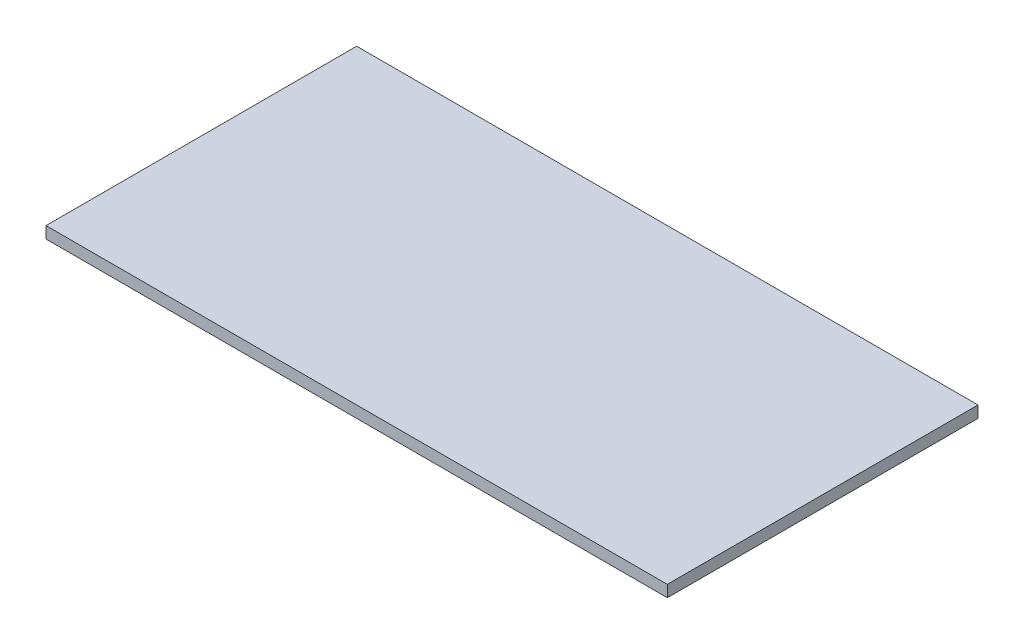
ISO-10303-21;
HEADER;
FILE_DESCRIPTION(('STEP AP214'),'2;1');
FILE_NAME('part.step','',(''),(''),'','','');
FILE_SCHEMA(('AUTOMOTIVE_DESIGN { 1 0 10303 214 1 1 1 1 }'));
ENDSEC;
DATA;
#1=APPLICATION_CONTEXT('core data for automotive mechanical design processes');
#2=APPLICATION_PROTOCOL_DEFINITION('international standard','automotive_design',2000,#1);
#3=PRODUCT_CONTEXT('',#1,'mechanical');
#4=PRODUCT('Part','Part','',(#3));
#5=PRODUCT_RELATED_PRODUCT_CATEGORY('part','',(#4));
#6=PRODUCT_DEFINITION_FORMATION('','',#4);
#7=PRODUCT_DEFINITION_CONTEXT('part definition',#1,'design');
#8=PRODUCT_DEFINITION('design','',#6,#7);
#9=PRODUCT_DEFINITION_SHAPE('','',#8);
#10=(LENGTH_UNIT() NAMED_UNIT(*) SI_UNIT(.MILLI.,.METRE.));
#11=(NAMED_UNIT(*) PLANE_ANGLE_UNIT() SI_UNIT($,.RADIAN.));
#12=(NAMED_UNIT(*) SI_UNIT($,.STERADIAN.) SOLID_ANGLE_UNIT());
#13=UNCERTAINTY_MEASURE_WITH_UNIT(LENGTH_MEASURE(1.E-05),#10,'distance_accuracy_value','');
#14=(GEOMETRIC_REPRESENTATION_CONTEXT(3) GLOBAL_UNCERTAINTY_ASSIGNED_CONTEXT((#13)) GLOBAL_UNIT_ASSIGNED_CONTEXT((#10,
#11,#12)) REPRESENTATION_CONTEXT('',''));
#15=CARTESIAN_POINT('',(0.,0.,0.));
#16=DIRECTION('',(0.,0.,1.));
#17=DIRECTION('',(1.,0.,0.));
#18=AXIS2_PLACEMENT_3D('',#15,#16,#17);
#19=CARTESIAN_POINT('',(0.,15.,0.));
#20=DIRECTION('',(1.,0.,0.));
#21=DIRECTION('',(0.,0.,-1.));
#22=AXIS2_PLACEMENT_3D('',#19,#20,#21);
#23=PLANE('',#22);
#24=DIRECTION('',(0.,0.,1.));
#25=VECTOR('',#24,1.);
#26=CARTESIAN_POINT('',(0.,0.,0.));
#27=LINE('',#26,#25);
#28=CARTESIAN_POINT('',(0.,0.,-400.));
#29=VERTEX_POINT('',#28);
#30=CARTESIAN_POINT('',(0.,0.,0.));
#31=VERTEX_POINT('',#30);
#32=EDGE_CURVE('E96',#29,#31,#27,.T.);
#33=ORIENTED_EDGE('',*,*,#32,.T.);
#34=DIRECTION('',(0.,-1.,0.));
#35=VECTOR('',#34,1.);
#36=CARTESIAN_POINT('',(0.,15.,0.));
#37=LINE('',#36,#35);
#38=CARTESIAN_POINT('',(0.,15.,0.));
#39=VERTEX_POINT('',#38);
#40=EDGE_CURVE('E11',#39,#31,#37,.T.);
#41=ORIENTED_EDGE('',*,*,#40,.F.);
#42=DIRECTION('',(0.,0.,1.));
#43=VECTOR('',#42,1.);
#44=CARTESIAN_POINT('',(0.,15.,0.));
#45=LINE('',#44,#43);
#46=CARTESIAN_POINT('',(0.,15.,-400.));
#47=VERTEX_POINT('',#46);
#48=EDGE_CURVE('E84',#47,#39,#45,.T.);
#49=ORIENTED_EDGE('',*,*,#48,.F.);
#50=DIRECTION('',(0.,-1.,0.));
#51=VECTOR('',#50,1.);
#52=CARTESIAN_POINT('',(0.,15.,-400.));
#53=LINE('',#52,#51);
#54=EDGE_CURVE('E92',#47,#29,#53,.T.);
#55=ORIENTED_EDGE('',*,*,#54,.T.);
#56=EDGE_LOOP('',(#33,#41,#49,#55));
#57=FACE_BOUND('',#56,.T.);
#58=ADVANCED_FACE('F33',(#57),#23,.F.);
#59=CARTESIAN_POINT('',(0.,15.,0.));
#60=DIRECTION('',(0.,0.,-1.));
#61=DIRECTION('',(-1.,0.,0.));
#62=AXIS2_PLACEMENT_3D('',#59,#60,#61);
#63=PLANE('',#62);
#64=DIRECTION('',(1.,0.,0.));
#65=VECTOR('',#64,1.);
#66=CARTESIAN_POINT('',(0.,0.,0.));
#67=LINE('',#66,#65);
#68=CARTESIAN_POINT('',(800.,0.,0.));
#69=VERTEX_POINT('',#68);
#70=EDGE_CURVE('E88',#31,#69,#67,.T.);
#71=ORIENTED_EDGE('',*,*,#70,.T.);
#72=DIRECTION('',(0.,-1.,0.));
#73=VECTOR('',#72,1.);
#74=CARTESIAN_POINT('',(800.,15.,0.));
#75=LINE('',#74,#73);
#76=CARTESIAN_POINT('',(800.,15.,0.));
#77=VERTEX_POINT('',#76);
#78=EDGE_CURVE('E41',#77,#69,#75,.T.);
#79=ORIENTED_EDGE('',*,*,#78,.F.);
#80=DIRECTION('',(1.,0.,0.));
#81=VECTOR('',#80,1.);
#82=CARTESIAN_POINT('',(0.,15.,0.));
#83=LINE('',#82,#81);
#84=EDGE_CURVE('E79',#39,#77,#83,.T.);
#85=ORIENTED_EDGE('',*,*,#84,.F.);
#86=ORIENTED_EDGE('',*,*,#40,.T.);
#87=EDGE_LOOP('',(#71,#79,#85,#86));
#88=FACE_BOUND('',#87,.T.);
#89=ADVANCED_FACE('F87',(#88),#63,.F.);
#90=CARTESIAN_POINT('',(800.,15.,0.));
#91=DIRECTION('',(-1.,0.,0.));
#92=DIRECTION('',(0.,0.,1.));
#93=AXIS2_PLACEMENT_3D('',#90,#91,#92);
#94=PLANE('',#93);
#95=DIRECTION('',(0.,0.,-1.));
#96=VECTOR('',#95,1.);
#97=CARTESIAN_POINT('',(800.,0.,0.));
#98=LINE('',#97,#96);
#99=CARTESIAN_POINT('',(800.,0.,-400.));
#100=VERTEX_POINT('',#99);
#101=EDGE_CURVE('E66',#69,#100,#98,.T.);
#102=ORIENTED_EDGE('',*,*,#101,.T.);
#103=DIRECTION('',(0.,-1.,0.));
#104=VECTOR('',#103,1.);
#105=CARTESIAN_POINT('',(800.,15.,-400.));
#106=LINE('',#105,#104);
#107=CARTESIAN_POINT('',(800.,15.,-400.));
#108=VERTEX_POINT('',#107);
#109=EDGE_CURVE('E89',#108,#100,#106,.T.);
#110=ORIENTED_EDGE('',*,*,#109,.F.);
#111=DIRECTION('',(0.,0.,-1.));
#112=VECTOR('',#111,1.);
#113=CARTESIAN_POINT('',(800.,15.,0.));
#114=LINE('',#113,#112);
#115=EDGE_CURVE('E82',#77,#108,#114,.T.);
#116=ORIENTED_EDGE('',*,*,#115,.F.);
#117=ORIENTED_EDGE('',*,*,#78,.T.);
#118=EDGE_LOOP('',(#102,#110,#116,#117));
#119=FACE_BOUND('',#118,.T.);
#120=ADVANCED_FACE('F90',(#119),#94,.F.);
#121=CARTESIAN_POINT('',(0.,15.,-400.));
#122=DIRECTION('',(0.,0.,1.));
#123=DIRECTION('',(1.,0.,0.));
#124=AXIS2_PLACEMENT_3D('',#121,#122,#123);
#125=PLANE('',#124);
#126=DIRECTION('',(-1.,0.,0.));
#127=VECTOR('',#126,1.);
#128=CARTESIAN_POINT('',(0.,0.,-400.));
#129=LINE('',#128,#127);
#130=EDGE_CURVE('E72',#100,#29,#129,.T.);
#131=ORIENTED_EDGE('',*,*,#130,.T.);
#132=ORIENTED_EDGE('',*,*,#54,.F.);
#133=DIRECTION('',(-1.,0.,0.));
#134=VECTOR('',#133,1.);
#135=CARTESIAN_POINT('',(0.,15.,-400.));
#136=LINE('',#135,#134);
#137=EDGE_CURVE('E49',#108,#47,#136,.T.);
#138=ORIENTED_EDGE('',*,*,#137,.F.);
#139=ORIENTED_EDGE('',*,*,#109,.T.);
#140=EDGE_LOOP('',(#131,#132,#138,#139));
#141=FACE_BOUND('',#140,.T.);
#142=ADVANCED_FACE('F103',(#141),#125,.F.);
#143=CARTESIAN_POINT('',(0.,15.,0.));
#144=DIRECTION('',(0.,-1.,0.));
#145=DIRECTION('',(0.,0.,-1.));
#146=AXIS2_PLACEMENT_3D('',#143,#144,#145);
#147=PLANE('',#146);
#148=ORIENTED_EDGE('',*,*,#48,.T.);
#149=ORIENTED_EDGE('',*,*,#84,.T.);
#150=ORIENTED_EDGE('',*,*,#115,.T.);
#151=ORIENTED_EDGE('',*,*,#137,.T.);
#152=EDGE_LOOP('',(#148,#149,#150,#151));
#153=FACE_BOUND('',#152,.T.);
#154=ADVANCED_FACE('F80',(#153),#147,.F.);
#155=CARTESIAN_POINT('',(0.,0.,0.));
#156=DIRECTION('',(0.,-1.,0.));
#157=DIRECTION('',(0.,0.,-1.));
#158=AXIS2_PLACEMENT_3D('',#155,#156,#157);
#159=PLANE('',#158);
#160=ORIENTED_EDGE('',*,*,#32,.F.);
#161=ORIENTED_EDGE('',*,*,#130,.F.);
#162=ORIENTED_EDGE('',*,*,#101,.F.);
#163=ORIENTED_EDGE('',*,*,#70,.F.);
#164=EDGE_LOOP('',(#160,#161,#162,#163));
#165=FACE_BOUND('',#164,.T.);
#166=ADVANCED_FACE('F106',(#165),#159,.T.);
#167=CLOSED_SHELL('',(#58,#89,#120,#142,#154,#166));
#168=MANIFOLD_SOLID_BREP('B2',#167);
#169=ADVANCED_BREP_SHAPE_REPRESENTATION('',(#18,#168),#14);
#170=SHAPE_DEFINITION_REPRESENTATION(#9,#169);
ENDSEC;
END-ISO-10303-21;
